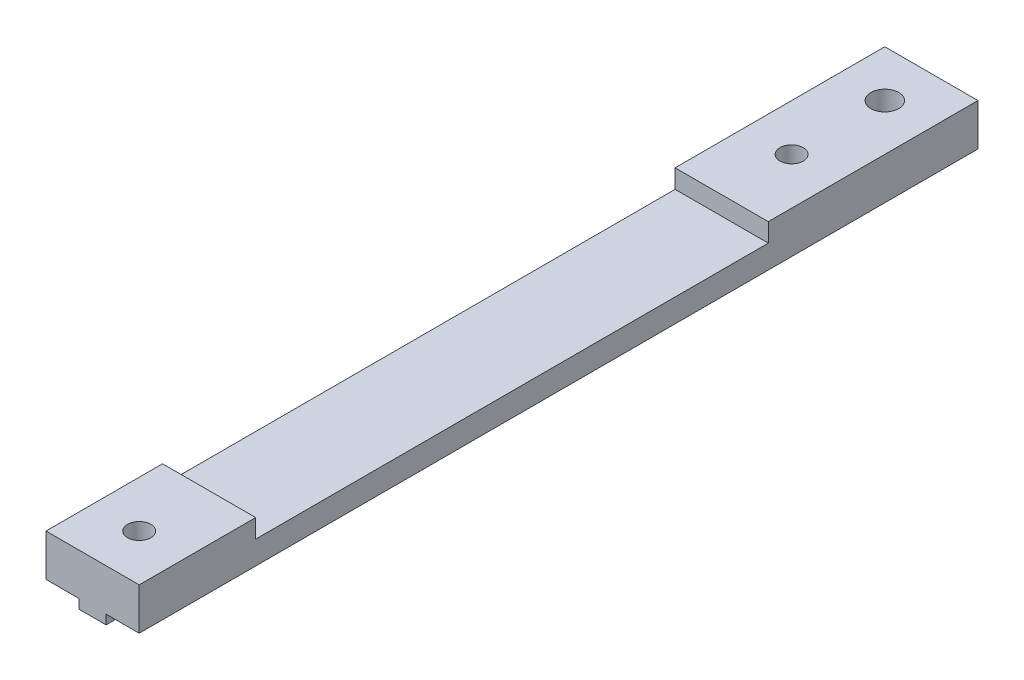
ISO-10303-21;
HEADER;
FILE_DESCRIPTION(('STEP AP214'),'2;1');
FILE_NAME('part.step','',(''),(''),'','','');
FILE_SCHEMA(('AUTOMOTIVE_DESIGN { 1 0 10303 214 1 1 1 1 }'));
ENDSEC;
DATA;
#1=APPLICATION_CONTEXT('core data for automotive mechanical design processes');
#2=APPLICATION_PROTOCOL_DEFINITION('international standard','automotive_design',2000,#1);
#3=PRODUCT_CONTEXT('',#1,'mechanical');
#4=PRODUCT('Part','Part','',(#3));
#5=PRODUCT_RELATED_PRODUCT_CATEGORY('part','',(#4));
#6=PRODUCT_DEFINITION_FORMATION('','',#4);
#7=PRODUCT_DEFINITION_CONTEXT('part definition',#1,'design');
#8=PRODUCT_DEFINITION('design','',#6,#7);
#9=PRODUCT_DEFINITION_SHAPE('','',#8);
#10=(LENGTH_UNIT() NAMED_UNIT(*) SI_UNIT(.MILLI.,.METRE.));
#11=(NAMED_UNIT(*) PLANE_ANGLE_UNIT() SI_UNIT($,.RADIAN.));
#12=(NAMED_UNIT(*) SI_UNIT($,.STERADIAN.) SOLID_ANGLE_UNIT());
#13=UNCERTAINTY_MEASURE_WITH_UNIT(LENGTH_MEASURE(1.E-05),#10,'distance_accuracy_value','');
#14=(GEOMETRIC_REPRESENTATION_CONTEXT(3) GLOBAL_UNCERTAINTY_ASSIGNED_CONTEXT((#13)) GLOBAL_UNIT_ASSIGNED_CONTEXT((#10,
#11,#12)) REPRESENTATION_CONTEXT('',''));
#15=CARTESIAN_POINT('',(0.,0.,0.));
#16=DIRECTION('',(0.,0.,1.));
#17=DIRECTION('',(1.,0.,0.));
#18=AXIS2_PLACEMENT_3D('',#15,#16,#17);
#19=CARTESIAN_POINT('',(-5.,0.,90.));
#20=DIRECTION('',(0.,-1.,0.));
#21=DIRECTION('',(1.,0.,0.));
#22=AXIS2_PLACEMENT_3D('',#19,#20,#21);
#23=PLANE('',#22);
#24=CARTESIAN_POINT('',(0.,0.,5.));
#25=DIRECTION('',(0.,1.,0.));
#26=DIRECTION('',(-1.,0.,0.));
#27=AXIS2_PLACEMENT_3D('',#24,#25,#26);
#28=CIRCLE('',#27,1.5);
#29=CARTESIAN_POINT('',(-1.5,0.,5.));
#30=VERTEX_POINT('',#29);
#31=EDGE_CURVE('E184',#30,#30,#28,.T.);
#32=ORIENTED_EDGE('',*,*,#31,.F.);
#33=EDGE_LOOP('',(#32));
#34=FACE_BOUND('',#33,.T.);
#35=CARTESIAN_POINT('',(0.,0.,15.));
#36=DIRECTION('',(0.,1.,0.));
#37=DIRECTION('',(-1.,0.,0.));
#38=AXIS2_PLACEMENT_3D('',#35,#36,#37);
#39=CIRCLE('',#38,1.25);
#40=CARTESIAN_POINT('',(-1.25,0.,15.));
#41=VERTEX_POINT('',#40);
#42=EDGE_CURVE('E177',#41,#41,#39,.T.);
#43=ORIENTED_EDGE('',*,*,#42,.F.);
#44=EDGE_LOOP('',(#43));
#45=FACE_BOUND('',#44,.T.);
#46=DIRECTION('',(0.,0.,-1.));
#47=VECTOR('',#46,1.);
#48=CARTESIAN_POINT('',(-5.,0.,90.));
#49=LINE('',#48,#47);
#50=CARTESIAN_POINT('',(-5.,0.,22.5));
#51=VERTEX_POINT('',#50);
#52=CARTESIAN_POINT('',(-5.,0.,0.));
#53=VERTEX_POINT('',#52);
#54=EDGE_CURVE('E227',#51,#53,#49,.T.);
#55=ORIENTED_EDGE('',*,*,#54,.F.);
#56=DIRECTION('',(-1.,0.,0.));
#57=VECTOR('',#56,1.);
#58=CARTESIAN_POINT('',(-5.,0.,22.5));
#59=LINE('',#58,#57);
#60=CARTESIAN_POINT('',(5.,0.,22.5));
#61=VERTEX_POINT('',#60);
#62=EDGE_CURVE('E161',#61,#51,#59,.T.);
#63=ORIENTED_EDGE('',*,*,#62,.F.);
#64=DIRECTION('',(0.,0.,-1.));
#65=VECTOR('',#64,1.);
#66=CARTESIAN_POINT('',(5.,0.,90.));
#67=LINE('',#66,#65);
#68=CARTESIAN_POINT('',(5.,0.,0.));
#69=VERTEX_POINT('',#68);
#70=EDGE_CURVE('E250',#61,#69,#67,.T.);
#71=ORIENTED_EDGE('',*,*,#70,.T.);
#72=DIRECTION('',(-1.,0.,0.));
#73=VECTOR('',#72,1.);
#74=CARTESIAN_POINT('',(-5.,0.,0.));
#75=LINE('',#74,#73);
#76=EDGE_CURVE('E213',#69,#53,#75,.T.);
#77=ORIENTED_EDGE('',*,*,#76,.T.);
#78=EDGE_LOOP('',(#55,#63,#71,#77));
#79=FACE_BOUND('',#78,.T.);
#80=ADVANCED_FACE('F33',(#34,#45,#79),#23,.F.);
#81=CARTESIAN_POINT('',(-1.45,-5.5,90.));
#82=DIRECTION('',(1.,0.,0.));
#83=DIRECTION('',(0.,1.,0.));
#84=AXIS2_PLACEMENT_3D('',#81,#82,#83);
#85=PLANE('',#84);
#86=DIRECTION('',(0.,0.,-1.));
#87=VECTOR('',#86,1.);
#88=CARTESIAN_POINT('',(-1.45,-5.5,90.));
#89=LINE('',#88,#87);
#90=CARTESIAN_POINT('',(-1.45,-5.5,4.61594271260657));
#91=VERTEX_POINT('',#90);
#92=CARTESIAN_POINT('',(-1.45,-5.5,0.));
#93=VERTEX_POINT('',#92);
#94=EDGE_CURVE('E265',#91,#93,#89,.T.);
#95=ORIENTED_EDGE('',*,*,#94,.F.);
#96=DIRECTION('',(0.,1.,0.));
#97=VECTOR('',#96,1.);
#98=CARTESIAN_POINT('',(-1.45,-5.5,4.61594271260657));
#99=LINE('',#98,#97);
#100=CARTESIAN_POINT('',(-1.45,-4.5,4.61594271260658));
#101=VERTEX_POINT('',#100);
#102=EDGE_CURVE('E199',#91,#101,#99,.T.);
#103=ORIENTED_EDGE('',*,*,#102,.T.);
#104=DIRECTION('',(0.,0.,-1.));
#105=VECTOR('',#104,1.);
#106=CARTESIAN_POINT('',(-1.45,-4.5,90.));
#107=LINE('',#106,#105);
#108=CARTESIAN_POINT('',(-1.45,-4.5,0.));
#109=VERTEX_POINT('',#108);
#110=EDGE_CURVE('E268',#101,#109,#107,.T.);
#111=ORIENTED_EDGE('',*,*,#110,.T.);
#112=DIRECTION('',(0.,-1.,0.));
#113=VECTOR('',#112,1.);
#114=CARTESIAN_POINT('',(-1.45,-5.5,0.));
#115=LINE('',#114,#113);
#116=EDGE_CURVE('E233',#109,#93,#115,.T.);
#117=ORIENTED_EDGE('',*,*,#116,.T.);
#118=EDGE_LOOP('',(#95,#103,#111,#117));
#119=FACE_BOUND('',#118,.T.);
#120=ADVANCED_FACE('F276',(#119),#85,.F.);
#121=CARTESIAN_POINT('',(1.45,-5.5,90.));
#122=DIRECTION('',(0.,1.,0.));
#123=DIRECTION('',(0.,0.,1.));
#124=AXIS2_PLACEMENT_3D('',#121,#122,#123);
#125=PLANE('',#124);
#126=DIRECTION('',(0.,0.,-1.));
#127=VECTOR('',#126,1.);
#128=CARTESIAN_POINT('',(1.45,-5.5,90.));
#129=LINE('',#128,#127);
#130=CARTESIAN_POINT('',(1.45,-5.5,4.61594271260657));
#131=VERTEX_POINT('',#130);
#132=CARTESIAN_POINT('',(1.45,-5.5,0.));
#133=VERTEX_POINT('',#132);
#134=EDGE_CURVE('E261',#131,#133,#129,.T.);
#135=ORIENTED_EDGE('',*,*,#134,.F.);
#136=CARTESIAN_POINT('',(0.,-5.5,5.));
#137=DIRECTION('',(0.,1.,0.));
#138=DIRECTION('',(-1.,0.,0.));
#139=AXIS2_PLACEMENT_3D('',#136,#137,#138);
#140=CIRCLE('',#139,1.5);
#141=EDGE_CURVE('E183',#131,#91,#140,.T.);
#142=ORIENTED_EDGE('',*,*,#141,.T.);
#143=ORIENTED_EDGE('',*,*,#94,.T.);
#144=DIRECTION('',(1.,0.,0.));
#145=VECTOR('',#144,1.);
#146=CARTESIAN_POINT('',(1.45,-5.5,0.));
#147=LINE('',#146,#145);
#148=EDGE_CURVE('E236',#93,#133,#147,.T.);
#149=ORIENTED_EDGE('',*,*,#148,.T.);
#150=EDGE_LOOP('',(#135,#142,#143,#149));
#151=FACE_BOUND('',#150,.T.);
#152=ADVANCED_FACE('F289',(#151),#125,.F.);
#153=CARTESIAN_POINT('',(1.45,-4.5,90.));
#154=DIRECTION('',(-1.,0.,0.));
#155=DIRECTION('',(0.,0.,1.));
#156=AXIS2_PLACEMENT_3D('',#153,#154,#155);
#157=PLANE('',#156);
#158=CARTESIAN_POINT('',(1.45,-5.5,90.));
#159=VERTEX_POINT('',#158);
#160=CARTESIAN_POINT('',(1.45,-5.5,5.38405728739344));
#161=VERTEX_POINT('',#160);
#162=EDGE_CURVE('E262',#159,#161,#129,.T.);
#163=ORIENTED_EDGE('',*,*,#162,.T.);
#164=DIRECTION('',(0.,1.,0.));
#165=VECTOR('',#164,1.);
#166=CARTESIAN_POINT('',(1.45,-5.5,5.38405728739344));
#167=LINE('',#166,#165);
#168=CARTESIAN_POINT('',(1.45,-4.5,5.38405728739344));
#169=VERTEX_POINT('',#168);
#170=EDGE_CURVE('E190',#161,#169,#167,.T.);
#171=ORIENTED_EDGE('',*,*,#170,.T.);
#172=DIRECTION('',(0.,0.,-1.));
#173=VECTOR('',#172,1.);
#174=CARTESIAN_POINT('',(1.45,-4.5,90.));
#175=LINE('',#174,#173);
#176=CARTESIAN_POINT('',(1.45,-4.5,90.));
#177=VERTEX_POINT('',#176);
#178=EDGE_CURVE('E258',#177,#169,#175,.T.);
#179=ORIENTED_EDGE('',*,*,#178,.F.);
#180=DIRECTION('',(0.,1.,0.));
#181=VECTOR('',#180,1.);
#182=CARTESIAN_POINT('',(1.45,-4.5,90.));
#183=LINE('',#182,#181);
#184=EDGE_CURVE('E219',#159,#177,#183,.T.);
#185=ORIENTED_EDGE('',*,*,#184,.F.);
#186=EDGE_LOOP('',(#163,#171,#179,#185));
#187=FACE_BOUND('',#186,.T.);
#188=ADVANCED_FACE('F301',(#187),#157,.F.);
#189=CARTESIAN_POINT('',(-5.,-4.5,90.));
#190=DIRECTION('',(1.,0.,0.));
#191=DIRECTION('',(0.,0.,-1.));
#192=AXIS2_PLACEMENT_3D('',#189,#190,#191);
#193=PLANE('',#192);
#194=DIRECTION('',(0.,0.,1.));
#195=VECTOR('',#194,1.);
#196=CARTESIAN_POINT('',(-5.,-2.,22.5));
#197=LINE('',#196,#195);
#198=CARTESIAN_POINT('',(-5.,-2.,22.5));
#199=VERTEX_POINT('',#198);
#200=CARTESIAN_POINT('',(-4.99999999999999,-2.,77.5));
#201=VERTEX_POINT('',#200);
#202=EDGE_CURVE('E152',#199,#201,#197,.T.);
#203=ORIENTED_EDGE('',*,*,#202,.F.);
#204=DIRECTION('',(0.,1.,0.));
#205=VECTOR('',#204,1.);
#206=CARTESIAN_POINT('',(-5.,-2.,22.5));
#207=LINE('',#206,#205);
#208=EDGE_CURVE('E187',#199,#51,#207,.T.);
#209=ORIENTED_EDGE('',*,*,#208,.T.);
#210=ORIENTED_EDGE('',*,*,#54,.T.);
#211=DIRECTION('',(0.,-1.,0.));
#212=VECTOR('',#211,1.);
#213=CARTESIAN_POINT('',(-5.,-4.5,0.));
#214=LINE('',#213,#212);
#215=CARTESIAN_POINT('',(-5.,-4.5,0.));
#216=VERTEX_POINT('',#215);
#217=EDGE_CURVE('E206',#53,#216,#214,.T.);
#218=ORIENTED_EDGE('',*,*,#217,.T.);
#219=DIRECTION('',(0.,0.,-1.));
#220=VECTOR('',#219,1.);
#221=CARTESIAN_POINT('',(-5.,-4.5,90.));
#222=LINE('',#221,#220);
#223=CARTESIAN_POINT('',(-5.,-4.5,90.));
#224=VERTEX_POINT('',#223);
#225=EDGE_CURVE('E11',#224,#216,#222,.T.);
#226=ORIENTED_EDGE('',*,*,#225,.F.);
#227=DIRECTION('',(0.,-1.,0.));
#228=VECTOR('',#227,1.);
#229=CARTESIAN_POINT('',(-5.,-4.5,90.));
#230=LINE('',#229,#228);
#231=CARTESIAN_POINT('',(-5.,0.,90.));
#232=VERTEX_POINT('',#231);
#233=EDGE_CURVE('E209',#232,#224,#230,.T.);
#234=ORIENTED_EDGE('',*,*,#233,.F.);
#235=CARTESIAN_POINT('',(-5.,0.,77.5));
#236=VERTEX_POINT('',#235);
#237=EDGE_CURVE('E166',#232,#236,#49,.T.);
#238=ORIENTED_EDGE('',*,*,#237,.T.);
#239=DIRECTION('',(0.,1.,0.));
#240=VECTOR('',#239,1.);
#241=CARTESIAN_POINT('',(-4.99999999999999,-2.,77.5));
#242=LINE('',#241,#240);
#243=EDGE_CURVE('E48',#201,#236,#242,.T.);
#244=ORIENTED_EDGE('',*,*,#243,.F.);
#245=EDGE_LOOP('',(#203,#209,#210,#218,#226,#234,#238,#244));
#246=FACE_BOUND('',#245,.T.);
#247=ADVANCED_FACE('F35',(#246),#193,.F.);
#248=CARTESIAN_POINT('',(-1.45,-4.5,90.));
#249=DIRECTION('',(0.,1.,0.));
#250=DIRECTION('',(-1.,0.,0.));
#251=AXIS2_PLACEMENT_3D('',#248,#249,#250);
#252=PLANE('',#251);
#253=ORIENTED_EDGE('',*,*,#110,.F.);
#254=CARTESIAN_POINT('',(0.,-4.5,5.));
#255=DIRECTION('',(0.,1.,0.));
#256=DIRECTION('',(-1.,0.,0.));
#257=AXIS2_PLACEMENT_3D('',#254,#255,#256);
#258=CIRCLE('',#257,1.5);
#259=CARTESIAN_POINT('',(-1.45,-4.5,5.38405728739343));
#260=VERTEX_POINT('',#259);
#261=EDGE_CURVE('E196',#101,#260,#258,.T.);
#262=ORIENTED_EDGE('',*,*,#261,.T.);
#263=CARTESIAN_POINT('',(-1.45,-4.5,90.));
#264=VERTEX_POINT('',#263);
#265=EDGE_CURVE('E41',#264,#260,#107,.T.);
#266=ORIENTED_EDGE('',*,*,#265,.F.);
#267=DIRECTION('',(1.,0.,0.));
#268=VECTOR('',#267,1.);
#269=CARTESIAN_POINT('',(-1.45,-4.5,90.));
#270=LINE('',#269,#268);
#271=EDGE_CURVE('E212',#224,#264,#270,.T.);
#272=ORIENTED_EDGE('',*,*,#271,.F.);
#273=ORIENTED_EDGE('',*,*,#225,.T.);
#274=DIRECTION('',(1.,0.,0.));
#275=VECTOR('',#274,1.);
#276=CARTESIAN_POINT('',(-1.45,-4.5,0.));
#277=LINE('',#276,#275);
#278=EDGE_CURVE('E230',#216,#109,#277,.T.);
#279=ORIENTED_EDGE('',*,*,#278,.T.);
#280=EDGE_LOOP('',(#253,#262,#266,#272,#273,#279));
#281=FACE_BOUND('',#280,.T.);
#282=ADVANCED_FACE('F280',(#281),#252,.F.);
#283=ORIENTED_EDGE('',*,*,#265,.T.);
#284=DIRECTION('',(0.,1.,0.));
#285=VECTOR('',#284,1.);
#286=CARTESIAN_POINT('',(-1.45,-5.5,5.38405728739343));
#287=LINE('',#286,#285);
#288=CARTESIAN_POINT('',(-1.45,-5.5,5.38405728739343));
#289=VERTEX_POINT('',#288);
#290=EDGE_CURVE('E193',#260,#289,#287,.F.);
#291=ORIENTED_EDGE('',*,*,#290,.T.);
#292=CARTESIAN_POINT('',(-1.45,-5.5,90.));
#293=VERTEX_POINT('',#292);
#294=EDGE_CURVE('E266',#293,#289,#89,.T.);
#295=ORIENTED_EDGE('',*,*,#294,.F.);
#296=DIRECTION('',(0.,-1.,0.));
#297=VECTOR('',#296,1.);
#298=CARTESIAN_POINT('',(-1.45,-5.5,90.));
#299=LINE('',#298,#297);
#300=EDGE_CURVE('E215',#264,#293,#299,.T.);
#301=ORIENTED_EDGE('',*,*,#300,.F.);
#302=EDGE_LOOP('',(#283,#291,#295,#301));
#303=FACE_BOUND('',#302,.T.);
#304=ADVANCED_FACE('F308',(#303),#85,.F.);
#305=CARTESIAN_POINT('',(0.,-5.5,15.));
#306=DIRECTION('',(0.,1.,0.));
#307=DIRECTION('',(-1.,0.,0.));
#308=AXIS2_PLACEMENT_3D('',#305,#306,#307);
#309=CIRCLE('',#308,1.25);
#310=CARTESIAN_POINT('',(-1.25,-5.5,15.));
#311=VERTEX_POINT('',#310);
#312=EDGE_CURVE('E173',#311,#311,#309,.T.);
#313=ORIENTED_EDGE('',*,*,#312,.T.);
#314=EDGE_LOOP('',(#313));
#315=FACE_BOUND('',#314,.T.);
#316=CARTESIAN_POINT('',(0.,-5.5,85.));
#317=DIRECTION('',(0.,1.,0.));
#318=DIRECTION('',(-1.,0.,0.));
#319=AXIS2_PLACEMENT_3D('',#316,#317,#318);
#320=CIRCLE('',#319,1.25);
#321=CARTESIAN_POINT('',(-1.25,-5.5,85.));
#322=VERTEX_POINT('',#321);
#323=EDGE_CURVE('E203',#322,#322,#320,.T.);
#324=ORIENTED_EDGE('',*,*,#323,.T.);
#325=EDGE_LOOP('',(#324));
#326=FACE_BOUND('',#325,.T.);
#327=ORIENTED_EDGE('',*,*,#294,.T.);
#328=EDGE_CURVE('E180',#289,#161,#140,.T.);
#329=ORIENTED_EDGE('',*,*,#328,.T.);
#330=ORIENTED_EDGE('',*,*,#162,.F.);
#331=DIRECTION('',(1.,0.,0.));
#332=VECTOR('',#331,1.);
#333=CARTESIAN_POINT('',(1.45,-5.5,90.));
#334=LINE('',#333,#332);
#335=EDGE_CURVE('E217',#293,#159,#334,.T.);
#336=ORIENTED_EDGE('',*,*,#335,.F.);
#337=EDGE_LOOP('',(#327,#329,#330,#336));
#338=FACE_BOUND('',#337,.T.);
#339=ADVANCED_FACE('F306',(#315,#326,#338),#125,.F.);
#340=CARTESIAN_POINT('',(1.45,-4.5,4.61594271260656));
#341=VERTEX_POINT('',#340);
#342=CARTESIAN_POINT('',(1.45,-4.5,0.));
#343=VERTEX_POINT('',#342);
#344=EDGE_CURVE('E257',#341,#343,#175,.T.);
#345=ORIENTED_EDGE('',*,*,#344,.F.);
#346=DIRECTION('',(0.,1.,0.));
#347=VECTOR('',#346,1.);
#348=CARTESIAN_POINT('',(1.45,-5.5,4.61594271260656));
#349=LINE('',#348,#347);
#350=EDGE_CURVE('E56',#341,#131,#349,.F.);
#351=ORIENTED_EDGE('',*,*,#350,.T.);
#352=ORIENTED_EDGE('',*,*,#134,.T.);
#353=DIRECTION('',(0.,1.,0.));
#354=VECTOR('',#353,1.);
#355=CARTESIAN_POINT('',(1.45,-4.5,0.));
#356=LINE('',#355,#354);
#357=EDGE_CURVE('E239',#133,#343,#356,.T.);
#358=ORIENTED_EDGE('',*,*,#357,.T.);
#359=EDGE_LOOP('',(#345,#351,#352,#358));
#360=FACE_BOUND('',#359,.T.);
#361=ADVANCED_FACE('F294',(#360),#157,.F.);
#362=CARTESIAN_POINT('',(5.,-4.5,90.));
#363=DIRECTION('',(0.,1.,0.));
#364=DIRECTION('',(-1.,0.,0.));
#365=AXIS2_PLACEMENT_3D('',#362,#363,#364);
#366=PLANE('',#365);
#367=ORIENTED_EDGE('',*,*,#178,.T.);
#368=CARTESIAN_POINT('',(0.,-4.5,5.));
#369=DIRECTION('',(0.,1.,0.));
#370=DIRECTION('',(-1.,0.,0.));
#371=AXIS2_PLACEMENT_3D('',#368,#369,#370);
#372=CIRCLE('',#371,1.5);
#373=EDGE_CURVE('E176',#169,#341,#372,.T.);
#374=ORIENTED_EDGE('',*,*,#373,.T.);
#375=ORIENTED_EDGE('',*,*,#344,.T.);
#376=DIRECTION('',(1.,0.,0.));
#377=VECTOR('',#376,1.);
#378=CARTESIAN_POINT('',(5.,-4.5,0.));
#379=LINE('',#378,#377);
#380=CARTESIAN_POINT('',(5.,-4.5,0.));
#381=VERTEX_POINT('',#380);
#382=EDGE_CURVE('E242',#343,#381,#379,.T.);
#383=ORIENTED_EDGE('',*,*,#382,.T.);
#384=DIRECTION('',(0.,0.,-1.));
#385=VECTOR('',#384,1.);
#386=CARTESIAN_POINT('',(5.,-4.5,90.));
#387=LINE('',#386,#385);
#388=CARTESIAN_POINT('',(5.,-4.5,90.));
#389=VERTEX_POINT('',#388);
#390=EDGE_CURVE('E254',#389,#381,#387,.T.);
#391=ORIENTED_EDGE('',*,*,#390,.F.);
#392=DIRECTION('',(1.,0.,0.));
#393=VECTOR('',#392,1.);
#394=CARTESIAN_POINT('',(5.,-4.5,90.));
#395=LINE('',#394,#393);
#396=EDGE_CURVE('E221',#177,#389,#395,.T.);
#397=ORIENTED_EDGE('',*,*,#396,.F.);
#398=EDGE_LOOP('',(#367,#374,#375,#383,#391,#397));
#399=FACE_BOUND('',#398,.T.);
#400=ADVANCED_FACE('F296',(#399),#366,.F.);
#401=CARTESIAN_POINT('',(5.,0.,90.));
#402=DIRECTION('',(-1.,0.,0.));
#403=DIRECTION('',(0.,-1.,0.));
#404=AXIS2_PLACEMENT_3D('',#401,#402,#403);
#405=PLANE('',#404);
#406=ORIENTED_EDGE('',*,*,#70,.F.);
#407=DIRECTION('',(0.,1.,0.));
#408=VECTOR('',#407,1.);
#409=CARTESIAN_POINT('',(5.,-2.,22.5));
#410=LINE('',#409,#408);
#411=CARTESIAN_POINT('',(5.,-2.,22.5));
#412=VERTEX_POINT('',#411);
#413=EDGE_CURVE('E168',#412,#61,#410,.T.);
#414=ORIENTED_EDGE('',*,*,#413,.F.);
#415=DIRECTION('',(0.,0.,-1.));
#416=VECTOR('',#415,1.);
#417=CARTESIAN_POINT('',(5.,-2.,22.5));
#418=LINE('',#417,#416);
#419=CARTESIAN_POINT('',(5.,-2.,77.5));
#420=VERTEX_POINT('',#419);
#421=EDGE_CURVE('E151',#420,#412,#418,.T.);
#422=ORIENTED_EDGE('',*,*,#421,.F.);
#423=DIRECTION('',(0.,1.,0.));
#424=VECTOR('',#423,1.);
#425=CARTESIAN_POINT('',(5.,-2.,77.5));
#426=LINE('',#425,#424);
#427=CARTESIAN_POINT('',(5.,0.,77.5));
#428=VERTEX_POINT('',#427);
#429=EDGE_CURVE('E148',#420,#428,#426,.T.);
#430=ORIENTED_EDGE('',*,*,#429,.T.);
#431=CARTESIAN_POINT('',(5.,0.,90.));
#432=VERTEX_POINT('',#431);
#433=EDGE_CURVE('E251',#432,#428,#67,.T.);
#434=ORIENTED_EDGE('',*,*,#433,.F.);
#435=DIRECTION('',(0.,1.,0.));
#436=VECTOR('',#435,1.);
#437=CARTESIAN_POINT('',(5.,0.,90.));
#438=LINE('',#437,#436);
#439=EDGE_CURVE('E223',#389,#432,#438,.T.);
#440=ORIENTED_EDGE('',*,*,#439,.F.);
#441=ORIENTED_EDGE('',*,*,#390,.T.);
#442=DIRECTION('',(0.,1.,0.));
#443=VECTOR('',#442,1.);
#444=CARTESIAN_POINT('',(5.,0.,0.));
#445=LINE('',#444,#443);
#446=EDGE_CURVE('E244',#381,#69,#445,.T.);
#447=ORIENTED_EDGE('',*,*,#446,.T.);
#448=EDGE_LOOP('',(#406,#414,#422,#430,#434,#440,#441,#447));
#449=FACE_BOUND('',#448,.T.);
#450=ADVANCED_FACE('F320',(#449),#405,.F.);
#451=CARTESIAN_POINT('',(0.,0.,85.));
#452=DIRECTION('',(0.,1.,0.));
#453=DIRECTION('',(-1.,0.,0.));
#454=AXIS2_PLACEMENT_3D('',#451,#452,#453);
#455=CIRCLE('',#454,1.25);
#456=CARTESIAN_POINT('',(-1.25,0.,85.));
#457=VERTEX_POINT('',#456);
#458=EDGE_CURVE('E202',#457,#457,#455,.T.);
#459=ORIENTED_EDGE('',*,*,#458,.F.);
#460=EDGE_LOOP('',(#459));
#461=FACE_BOUND('',#460,.T.);
#462=ORIENTED_EDGE('',*,*,#433,.T.);
#463=DIRECTION('',(1.,0.,0.));
#464=VECTOR('',#463,1.);
#465=CARTESIAN_POINT('',(-4.99999999999999,0.,77.5));
#466=LINE('',#465,#464);
#467=EDGE_CURVE('E325',#236,#428,#466,.T.);
#468=ORIENTED_EDGE('',*,*,#467,.F.);
#469=ORIENTED_EDGE('',*,*,#237,.F.);
#470=DIRECTION('',(-1.,0.,0.));
#471=VECTOR('',#470,1.);
#472=CARTESIAN_POINT('',(-5.,0.,90.));
#473=LINE('',#472,#471);
#474=EDGE_CURVE('E225',#432,#232,#473,.T.);
#475=ORIENTED_EDGE('',*,*,#474,.F.);
#476=EDGE_LOOP('',(#462,#468,#469,#475));
#477=FACE_BOUND('',#476,.T.);
#478=ADVANCED_FACE('F324',(#461,#477),#23,.F.);
#479=CARTESIAN_POINT('',(0.,0.,90.));
#480=DIRECTION('',(0.,0.,-1.));
#481=DIRECTION('',(-1.,0.,0.));
#482=AXIS2_PLACEMENT_3D('',#479,#480,#481);
#483=PLANE('',#482);
#484=ORIENTED_EDGE('',*,*,#233,.T.);
#485=ORIENTED_EDGE('',*,*,#271,.T.);
#486=ORIENTED_EDGE('',*,*,#300,.T.);
#487=ORIENTED_EDGE('',*,*,#335,.T.);
#488=ORIENTED_EDGE('',*,*,#184,.T.);
#489=ORIENTED_EDGE('',*,*,#396,.T.);
#490=ORIENTED_EDGE('',*,*,#439,.T.);
#491=ORIENTED_EDGE('',*,*,#474,.T.);
#492=EDGE_LOOP('',(#484,#485,#486,#487,#488,#489,#490,#491));
#493=FACE_BOUND('',#492,.T.);
#494=ADVANCED_FACE('F310',(#493),#483,.F.);
#495=CARTESIAN_POINT('',(0.,0.,0.));
#496=DIRECTION('',(0.,0.,-1.));
#497=DIRECTION('',(-1.,0.,0.));
#498=AXIS2_PLACEMENT_3D('',#495,#496,#497);
#499=PLANE('',#498);
#500=ORIENTED_EDGE('',*,*,#217,.F.);
#501=ORIENTED_EDGE('',*,*,#76,.F.);
#502=ORIENTED_EDGE('',*,*,#446,.F.);
#503=ORIENTED_EDGE('',*,*,#382,.F.);
#504=ORIENTED_EDGE('',*,*,#357,.F.);
#505=ORIENTED_EDGE('',*,*,#148,.F.);
#506=ORIENTED_EDGE('',*,*,#116,.F.);
#507=ORIENTED_EDGE('',*,*,#278,.F.);
#508=EDGE_LOOP('',(#500,#501,#502,#503,#504,#505,#506,#507));
#509=FACE_BOUND('',#508,.T.);
#510=ADVANCED_FACE('F284',(#509),#499,.T.);
#511=CARTESIAN_POINT('',(0.,-5.5,85.));
#512=DIRECTION('',(0.,1.,0.));
#513=DIRECTION('',(-1.,0.,0.));
#514=AXIS2_PLACEMENT_3D('',#511,#512,#513);
#515=CYLINDRICAL_SURFACE('',#514,1.25);
#516=ORIENTED_EDGE('',*,*,#323,.F.);
#517=EDGE_LOOP('',(#516));
#518=FACE_BOUND('',#517,.T.);
#519=ORIENTED_EDGE('',*,*,#458,.T.);
#520=EDGE_LOOP('',(#519));
#521=FACE_BOUND('',#520,.T.);
#522=ADVANCED_FACE('F363',(#518,#521),#515,.F.);
#523=CARTESIAN_POINT('',(0.,-5.5,5.));
#524=DIRECTION('',(0.,1.,0.));
#525=DIRECTION('',(-1.,0.,0.));
#526=AXIS2_PLACEMENT_3D('',#523,#524,#525);
#527=CYLINDRICAL_SURFACE('',#526,1.5);
#528=ORIENTED_EDGE('',*,*,#31,.T.);
#529=EDGE_LOOP('',(#528));
#530=FACE_BOUND('',#529,.T.);
#531=ORIENTED_EDGE('',*,*,#141,.F.);
#532=ORIENTED_EDGE('',*,*,#350,.F.);
#533=ORIENTED_EDGE('',*,*,#373,.F.);
#534=ORIENTED_EDGE('',*,*,#170,.F.);
#535=ORIENTED_EDGE('',*,*,#328,.F.);
#536=ORIENTED_EDGE('',*,*,#290,.F.);
#537=ORIENTED_EDGE('',*,*,#261,.F.);
#538=ORIENTED_EDGE('',*,*,#102,.F.);
#539=EDGE_LOOP('',(#531,#532,#533,#534,#535,#536,#537,#538));
#540=FACE_BOUND('',#539,.T.);
#541=ADVANCED_FACE('F291',(#530,#540),#527,.F.);
#542=CARTESIAN_POINT('',(0.,-5.5,15.));
#543=DIRECTION('',(0.,1.,0.));
#544=DIRECTION('',(-1.,0.,0.));
#545=AXIS2_PLACEMENT_3D('',#542,#543,#544);
#546=CYLINDRICAL_SURFACE('',#545,1.25);
#547=ORIENTED_EDGE('',*,*,#312,.F.);
#548=EDGE_LOOP('',(#547));
#549=FACE_BOUND('',#548,.T.);
#550=ORIENTED_EDGE('',*,*,#42,.T.);
#551=EDGE_LOOP('',(#550));
#552=FACE_BOUND('',#551,.T.);
#553=ADVANCED_FACE('F333',(#549,#552),#546,.F.);
#554=CARTESIAN_POINT('',(-5.,-2.,22.5));
#555=DIRECTION('',(0.,0.,-1.));
#556=DIRECTION('',(-1.,0.,0.));
#557=AXIS2_PLACEMENT_3D('',#554,#555,#556);
#558=PLANE('',#557);
#559=ORIENTED_EDGE('',*,*,#62,.T.);
#560=ORIENTED_EDGE('',*,*,#208,.F.);
#561=DIRECTION('',(-1.,0.,0.));
#562=VECTOR('',#561,1.);
#563=CARTESIAN_POINT('',(-5.,-2.,22.5));
#564=LINE('',#563,#562);
#565=EDGE_CURVE('E158',#412,#199,#564,.T.);
#566=ORIENTED_EDGE('',*,*,#565,.F.);
#567=ORIENTED_EDGE('',*,*,#413,.T.);
#568=EDGE_LOOP('',(#559,#560,#566,#567));
#569=FACE_BOUND('',#568,.T.);
#570=ADVANCED_FACE('F331',(#569),#558,.F.);
#571=CARTESIAN_POINT('',(-4.99999999999999,-2.,77.5));
#572=DIRECTION('',(0.,0.,1.));
#573=DIRECTION('',(1.,0.,0.));
#574=AXIS2_PLACEMENT_3D('',#571,#572,#573);
#575=PLANE('',#574);
#576=ORIENTED_EDGE('',*,*,#467,.T.);
#577=ORIENTED_EDGE('',*,*,#429,.F.);
#578=DIRECTION('',(1.,0.,0.));
#579=VECTOR('',#578,1.);
#580=CARTESIAN_POINT('',(-4.99999999999999,-2.,77.5));
#581=LINE('',#580,#579);
#582=EDGE_CURVE('E144',#201,#420,#581,.T.);
#583=ORIENTED_EDGE('',*,*,#582,.F.);
#584=ORIENTED_EDGE('',*,*,#243,.T.);
#585=EDGE_LOOP('',(#576,#577,#583,#584));
#586=FACE_BOUND('',#585,.T.);
#587=ADVANCED_FACE('F146',(#586),#575,.F.);
#588=CARTESIAN_POINT('',(0.,-2.,0.));
#589=DIRECTION('',(0.,1.,0.));
#590=DIRECTION('',(-1.,0.,0.));
#591=AXIS2_PLACEMENT_3D('',#588,#589,#590);
#592=PLANE('',#591);
#593=ORIENTED_EDGE('',*,*,#202,.T.);
#594=ORIENTED_EDGE('',*,*,#582,.T.);
#595=ORIENTED_EDGE('',*,*,#421,.T.);
#596=ORIENTED_EDGE('',*,*,#565,.T.);
#597=EDGE_LOOP('',(#593,#594,#595,#596));
#598=FACE_BOUND('',#597,.T.);
#599=ADVANCED_FACE('F156',(#598),#592,.T.);
#600=CLOSED_SHELL('',(#80,#120,#152,#188,#247,#282,#304,#339,#361,#400,#450,#478,#494,#510,#522,
#541,#553,#570,#587,#599));
#601=MANIFOLD_SOLID_BREP('B2',#600);
#602=ADVANCED_BREP_SHAPE_REPRESENTATION('',(#18,#601),#14);
#603=SHAPE_DEFINITION_REPRESENTATION(#9,#602);
ENDSEC;
END-ISO-10303-21;
